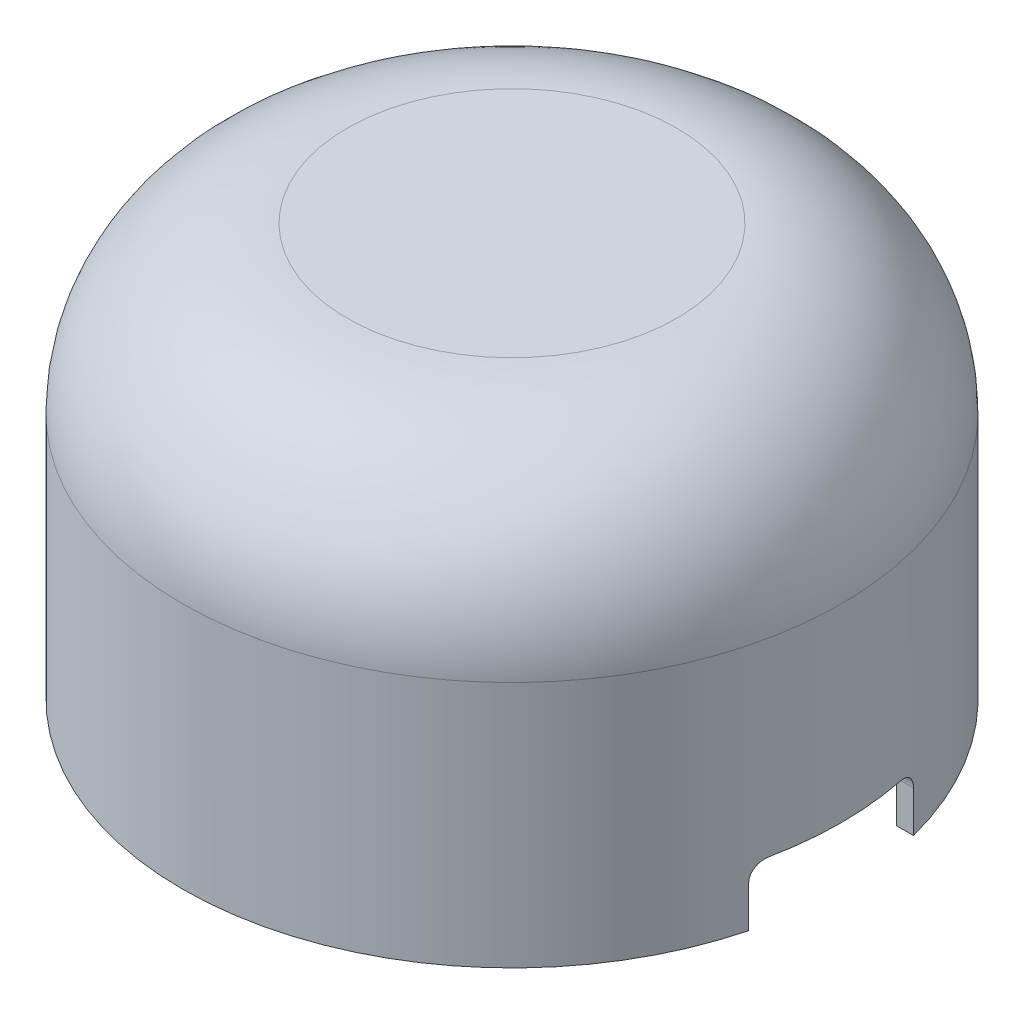
ISO-10303-21;
HEADER;
FILE_DESCRIPTION(('STEP AP214'),'2;1');
FILE_NAME('part.step','',(''),(''),'','','');
FILE_SCHEMA(('AUTOMOTIVE_DESIGN { 1 0 10303 214 1 1 1 1 }'));
ENDSEC;
DATA;
#1=APPLICATION_CONTEXT('core data for automotive mechanical design processes');
#2=APPLICATION_PROTOCOL_DEFINITION('international standard','automotive_design',2000,#1);
#3=PRODUCT_CONTEXT('',#1,'mechanical');
#4=PRODUCT('Part','Part','',(#3));
#5=PRODUCT_RELATED_PRODUCT_CATEGORY('part','',(#4));
#6=PRODUCT_DEFINITION_FORMATION('','',#4);
#7=PRODUCT_DEFINITION_CONTEXT('part definition',#1,'design');
#8=PRODUCT_DEFINITION('design','',#6,#7);
#9=PRODUCT_DEFINITION_SHAPE('','',#8);
#10=(LENGTH_UNIT() NAMED_UNIT(*) SI_UNIT(.MILLI.,.METRE.));
#11=(NAMED_UNIT(*) PLANE_ANGLE_UNIT() SI_UNIT($,.RADIAN.));
#12=(NAMED_UNIT(*) SI_UNIT($,.STERADIAN.) SOLID_ANGLE_UNIT());
#13=UNCERTAINTY_MEASURE_WITH_UNIT(LENGTH_MEASURE(1.E-05),#10,'distance_accuracy_value','');
#14=(GEOMETRIC_REPRESENTATION_CONTEXT(3) GLOBAL_UNCERTAINTY_ASSIGNED_CONTEXT((#13)) GLOBAL_UNIT_ASSIGNED_CONTEXT((#10,
#11,#12)) REPRESENTATION_CONTEXT('',''));
#15=CARTESIAN_POINT('',(0.,0.,0.));
#16=DIRECTION('',(0.,0.,1.));
#17=DIRECTION('',(1.,0.,0.));
#18=AXIS2_PLACEMENT_3D('',#15,#16,#17);
#19=CARTESIAN_POINT('',(0.,0.,0.));
#20=DIRECTION('',(0.,-1.,0.));
#21=DIRECTION('',(0.,0.,-1.));
#22=AXIS2_PLACEMENT_3D('',#19,#20,#21);
#23=PLANE('',#22);
#24=CARTESIAN_POINT('',(0.,0.,0.));
#25=DIRECTION('',(0.,-1.,0.));
#26=DIRECTION('',(0.,0.,-1.));
#27=AXIS2_PLACEMENT_3D('',#24,#25,#26);
#28=CIRCLE('',#27,38.);
#29=CARTESIAN_POINT('',(36.6606055596467,1.45716771982052E-13,10.));
#30=VERTEX_POINT('',#29);
#31=CARTESIAN_POINT('',(36.6606055596467,1.49390712379494E-13,-10.));
#32=VERTEX_POINT('',#31);
#33=EDGE_CURVE('E119',#30,#32,#28,.T.);
#34=ORIENTED_EDGE('',*,*,#33,.F.);
#35=DIRECTION('',(-1.,0.,0.));
#36=VECTOR('',#35,1.);
#37=CARTESIAN_POINT('',(56.,1.45716771982052E-13,10.));
#38=LINE('',#37,#36);
#39=CARTESIAN_POINT('',(38.7298334620742,1.45716771982052E-13,10.));
#40=VERTEX_POINT('',#39);
#41=EDGE_CURVE('E58',#40,#30,#38,.T.);
#42=ORIENTED_EDGE('',*,*,#41,.F.);
#43=CARTESIAN_POINT('',(0.,1.45716771982052E-13,0.));
#44=DIRECTION('',(0.,-1.,0.));
#45=DIRECTION('',(0.,0.,-1.));
#46=AXIS2_PLACEMENT_3D('',#43,#44,#45);
#47=CIRCLE('',#46,40.);
#48=CARTESIAN_POINT('',(38.7298334620742,1.49390712379494E-13,-10.));
#49=VERTEX_POINT('',#48);
#50=EDGE_CURVE('E105',#40,#49,#47,.T.);
#51=ORIENTED_EDGE('',*,*,#50,.T.);
#52=DIRECTION('',(-1.,0.,0.));
#53=VECTOR('',#52,1.);
#54=CARTESIAN_POINT('',(56.,1.49390712379494E-13,-10.));
#55=LINE('',#54,#53);
#56=EDGE_CURVE('E190',#49,#32,#55,.T.);
#57=ORIENTED_EDGE('',*,*,#56,.T.);
#58=EDGE_LOOP('',(#34,#42,#51,#57));
#59=FACE_BOUND('',#58,.T.);
#60=ADVANCED_FACE('F38',(#59),#23,.T.);
#61=CARTESIAN_POINT('',(0.,0.,0.));
#62=DIRECTION('',(0.,-1.,0.));
#63=DIRECTION('',(0.,0.,-1.));
#64=AXIS2_PLACEMENT_3D('',#61,#62,#63);
#65=CYLINDRICAL_SURFACE('',#64,40.);
#66=CARTESIAN_POINT('',(0.,30.,0.));
#67=DIRECTION('',(0.,-1.,0.));
#68=DIRECTION('',(0.,0.,-1.));
#69=AXIS2_PLACEMENT_3D('',#66,#67,#68);
#70=CIRCLE('',#69,40.);
#71=CARTESIAN_POINT('',(0.,30.,-40.));
#72=VERTEX_POINT('',#71);
#73=EDGE_CURVE('E127',#72,#72,#70,.T.);
#74=ORIENTED_EDGE('',*,*,#73,.T.);
#75=EDGE_LOOP('',(#74));
#76=FACE_BOUND('',#75,.T.);
#77=ORIENTED_EDGE('',*,*,#50,.F.);
#78=DIRECTION('',(0.,-1.,0.));
#79=VECTOR('',#78,1.);
#80=CARTESIAN_POINT('',(38.7298334620742,0.,10.));
#81=LINE('',#80,#79);
#82=CARTESIAN_POINT('',(38.7298334620742,5.00000000000013,10.));
#83=VERTEX_POINT('',#82);
#84=EDGE_CURVE('E98',#40,#83,#81,.F.);
#85=ORIENTED_EDGE('',*,*,#84,.T.);
#86=CARTESIAN_POINT('',(38.7298334620742,5.00000000000013,10.));
#87=CARTESIAN_POINT('',(38.7298326194399,5.05505160137666,10.0000005771362));
#88=CARTESIAN_POINT('',(38.7304208108248,5.11007627264321,9.99772549905803));
#89=CARTESIAN_POINT('',(38.7327612192509,5.21972012451846,9.98865560864686));
#90=CARTESIAN_POINT('',(38.7345132925186,5.27433935436848,9.98186135456433));
#91=CARTESIAN_POINT('',(38.741482310767,5.43679792983441,9.95479366464594));
#92=CARTESIAN_POINT('',(38.748412211819,5.54353002242645,9.92783491494343));
#93=CARTESIAN_POINT('',(38.7664981412727,5.75077277523149,9.85697423116709));
#94=CARTESIAN_POINT('',(38.7776546537335,5.85128272130917,9.81307035641617));
#95=CARTESIAN_POINT('',(38.8036640630983,6.0434501089711,9.70971086036322));
#96=CARTESIAN_POINT('',(38.8185173935021,6.13510651061183,9.65025341516215));
#97=CARTESIAN_POINT('',(38.8515119609192,6.30852357271044,9.51655489343727));
#98=CARTESIAN_POINT('',(38.8696999376451,6.3901117678665,9.44210194949403));
#99=CARTESIAN_POINT('',(38.908447298594,6.53972609163972,9.28114062482061));
#100=CARTESIAN_POINT('',(38.9290073202375,6.60774856138726,9.19462900235315));
#101=CARTESIAN_POINT('',(38.9723255318063,6.73033321970062,9.00928119652171));
#102=CARTESIAN_POINT('',(38.9951300936365,6.78444930401798,8.91016096701512));
#103=CARTESIAN_POINT('',(39.0415696534439,6.87521264192984,8.7044208509998));
#104=CARTESIAN_POINT('',(39.0652043721719,6.91186571046095,8.59780347452467));
#105=CARTESIAN_POINT('',(39.1061917820344,6.95945180480397,8.40906887903328));
#106=CARTESIAN_POINT('',(39.1235399315422,6.9746361473541,8.32799514260831));
#107=CARTESIAN_POINT('',(39.1579577626541,6.99491136718172,8.16464317071732));
#108=CARTESIAN_POINT('',(39.1750277591468,7.00001457757774,8.08236653122535));
#109=CARTESIAN_POINT('',(39.1918358845309,7.00000000000015,7.99999999999999));
#110=B_SPLINE_CURVE_WITH_KNOTS('',3,(#86,#87,#88,#89,#90,#91,#92,#93,#94,#95,#96,#97,#98,#99,
#100,#101,#102,#103,#104,#105,#106,#107,#108,#109),.UNSPECIFIED.,.F.,.F.,(4,2,2,2,2,2,2,2,2,2,2,
4),(0.,0.165051489223085,0.330082593544818,0.659280561114503,0.988516241986097,1.31779054820353,
1.65209249814677,1.98648449251229,2.33054597314569,2.67449280597505,2.92677175863386,
3.17874188508126),.UNSPECIFIED.);
#111=CARTESIAN_POINT('',(39.1918358845308,7.00000000000015,7.99999999999999));
#112=VERTEX_POINT('',#111);
#113=EDGE_CURVE('E88',#83,#112,#110,.T.);
#114=ORIENTED_EDGE('',*,*,#113,.T.);
#115=CARTESIAN_POINT('',(0.,7.00000000000015,0.));
#116=DIRECTION('',(0.,-1.,0.));
#117=DIRECTION('',(0.,0.,-1.));
#118=AXIS2_PLACEMENT_3D('',#115,#116,#117);
#119=CIRCLE('',#118,40.);
#120=CARTESIAN_POINT('',(39.1918358845308,7.00000000000015,-7.99999999999998));
#121=VERTEX_POINT('',#120);
#122=EDGE_CURVE('E95',#112,#121,#119,.F.);
#123=ORIENTED_EDGE('',*,*,#122,.T.);
#124=CARTESIAN_POINT('',(39.1918358845308,7.00000000000015,-7.99999999999998));
#125=CARTESIAN_POINT('',(39.1801057078813,6.99999901500845,-8.05746948791519));
#126=CARTESIAN_POINT('',(39.1682533332822,6.99752152938724,-8.11488455451955));
#127=CARTESIAN_POINT('',(39.1443841446907,6.98764719836224,-8.22925235277903));
#128=CARTESIAN_POINT('',(39.1323673398534,6.98025062575647,-8.2862051098952));
#129=CARTESIAN_POINT('',(39.0962185712984,6.95075707998548,-8.45570701496808));
#130=CARTESIAN_POINT('',(39.0719583370319,6.92135609231627,-8.56704617002827));
#131=CARTESIAN_POINT('',(39.023951163637,6.84387969088688,-8.78313882317792));
#132=CARTESIAN_POINT('',(39.0002044603987,6.79579587977729,-8.88788933524318));
#133=CARTESIAN_POINT('',(38.9541020246381,6.6822172660947,-9.08781928750434));
#134=CARTESIAN_POINT('',(38.9317459839982,6.61672633734874,-9.18300085071256));
#135=CARTESIAN_POINT('',(38.8894386886249,6.47040143090749,-9.36054832853201));
#136=CARTESIAN_POINT('',(38.8694762471487,6.3896437683989,-9.44297442866076));
#137=CARTESIAN_POINT('',(38.8327157250863,6.21471668249304,-9.59302732370191));
#138=CARTESIAN_POINT('',(38.8159179857379,6.12054581472178,-9.66065252281723));
#139=CARTESIAN_POINT('',(38.7866522378173,5.92377161247141,-9.77748257215076));
#140=CARTESIAN_POINT('',(38.7740937298787,5.82141132950929,-9.82707446259781));
#141=CARTESIAN_POINT('',(38.7534271823976,5.60941442866302,-9.90826189527754));
#142=CARTESIAN_POINT('',(38.7453145663691,5.49978542385804,-9.93987594470187));
#143=CARTESIAN_POINT('',(38.7363844819205,5.32435228397763,-9.97460170824541));
#144=CARTESIAN_POINT('',(38.7339310923897,5.25983141157121,-9.98412000028461));
#145=CARTESIAN_POINT('',(38.7306553087111,5.13021792680457,-9.99681726592573));
#146=CARTESIAN_POINT('',(38.7298306748911,5.06512622335207,-10.0000049446716));
#147=CARTESIAN_POINT('',(38.7298334620742,5.00000000000014,-10.));
#148=B_SPLINE_CURVE_WITH_KNOTS('',3,(#124,#125,#126,#127,#128,#129,#130,#131,#132,#133,#134,
#135,#136,#137,#138,#139,#140,#141,#142,#143,#144,#145,#146,#147),.UNSPECIFIED.,.F.,.F.,(4,2,2,
2,2,2,2,2,2,2,2,4),(0.,0.175853868904391,0.351697986286411,0.70294371193858,1.05434749461421,
1.4056731403232,1.75528692228245,2.10493838019947,2.4465673555439,2.7878440031478,
2.98334115976407,3.17856930413358),.UNSPECIFIED.);
#149=CARTESIAN_POINT('',(38.7298334620742,5.00000000000014,-10.));
#150=VERTEX_POINT('',#149);
#151=EDGE_CURVE('E112',#121,#150,#148,.T.);
#152=ORIENTED_EDGE('',*,*,#151,.T.);
#153=DIRECTION('',(0.,-1.,0.));
#154=VECTOR('',#153,1.);
#155=CARTESIAN_POINT('',(38.7298334620742,0.,-10.));
#156=LINE('',#155,#154);
#157=EDGE_CURVE('E107',#150,#49,#156,.T.);
#158=ORIENTED_EDGE('',*,*,#157,.T.);
#159=EDGE_LOOP('',(#77,#85,#114,#123,#152,#158));
#160=FACE_BOUND('',#159,.T.);
#161=ADVANCED_FACE('F102',(#76,#160),#65,.T.);
#162=CARTESIAN_POINT('',(0.,0.,0.));
#163=DIRECTION('',(0.,-1.,0.));
#164=DIRECTION('',(0.,0.,-1.));
#165=AXIS2_PLACEMENT_3D('',#162,#163,#164);
#166=CYLINDRICAL_SURFACE('',#165,38.);
#167=CARTESIAN_POINT('',(0.,30.,0.));
#168=DIRECTION('',(0.,-1.,0.));
#169=DIRECTION('',(0.,0.,-1.));
#170=AXIS2_PLACEMENT_3D('',#167,#168,#169);
#171=CIRCLE('',#170,38.);
#172=CARTESIAN_POINT('',(0.,30.,-38.));
#173=VERTEX_POINT('',#172);
#174=EDGE_CURVE('E116',#173,#173,#171,.T.);
#175=ORIENTED_EDGE('',*,*,#174,.F.);
#176=EDGE_LOOP('',(#175));
#177=FACE_BOUND('',#176,.T.);
#178=DIRECTION('',(0.,-1.,0.));
#179=VECTOR('',#178,1.);
#180=CARTESIAN_POINT('',(36.6606055596467,0.,10.));
#181=LINE('',#180,#179);
#182=CARTESIAN_POINT('',(36.6606055596467,5.00000000000013,10.));
#183=VERTEX_POINT('',#182);
#184=EDGE_CURVE('E11',#30,#183,#181,.F.);
#185=ORIENTED_EDGE('',*,*,#184,.F.);
#186=ORIENTED_EDGE('',*,*,#33,.T.);
#187=DIRECTION('',(0.,-1.,0.));
#188=VECTOR('',#187,1.);
#189=CARTESIAN_POINT('',(36.6606055596467,0.,-10.));
#190=LINE('',#189,#188);
#191=CARTESIAN_POINT('',(36.6606055596467,5.00000000000014,-10.));
#192=VERTEX_POINT('',#191);
#193=EDGE_CURVE('E45',#192,#32,#190,.T.);
#194=ORIENTED_EDGE('',*,*,#193,.F.);
#195=CARTESIAN_POINT('',(37.1483512420134,7.00000000000015,-7.99999999999998));
#196=CARTESIAN_POINT('',(37.1359464187979,6.99999894302811,-8.05760596565562));
#197=CARTESIAN_POINT('',(37.1234120687922,6.99750975976636,-8.11515426090105));
#198=CARTESIAN_POINT('',(37.0981688710217,6.9875899086923,-8.22978143171024));
#199=CARTESIAN_POINT('',(37.0854600331479,6.98015951985332,-8.2868603335911));
#200=CARTESIAN_POINT('',(37.0472274688415,6.95053228266421,-8.45673396601103));
#201=CARTESIAN_POINT('',(37.0215671439249,6.9209991783334,-8.56830729133277));
#202=CARTESIAN_POINT('',(36.9707870479754,6.84317510055917,-8.78483424486615));
#203=CARTESIAN_POINT('',(36.9456675229772,6.79487577218744,-8.88978490036685));
#204=CARTESIAN_POINT('',(36.896899159019,6.6807761897725,-9.09007455029695));
#205=CARTESIAN_POINT('',(36.8732499883708,6.6149799005632,-9.18541571550812));
#206=CARTESIAN_POINT('',(36.8285127388379,6.46798817032521,-9.36317374418333));
#207=CARTESIAN_POINT('',(36.8074114461195,6.38687831744895,-9.44565799817652));
#208=CARTESIAN_POINT('',(36.7685667084205,6.21115983442327,-9.59575577833714));
#209=CARTESIAN_POINT('',(36.7508235855586,6.11654991085956,-9.66336787805445));
#210=CARTESIAN_POINT('',(36.7199802677687,5.91909705151461,-9.77990815292064));
#211=CARTESIAN_POINT('',(36.706772930342,5.81652657521087,-9.82926996625864));
#212=CARTESIAN_POINT('',(36.6850724901174,5.604104365095,-9.90995559448285));
#213=CARTESIAN_POINT('',(36.6765742961966,5.49426063894615,-9.94129889082567));
#214=CARTESIAN_POINT('',(36.6673218022046,5.31954882597425,-9.97535284630271));
#215=CARTESIAN_POINT('',(36.6648064907828,5.2559747811444,-9.98458967127195));
#216=CARTESIAN_POINT('',(36.6614481547515,5.12827804909862,-9.9969112727901));
#217=CARTESIAN_POINT('',(36.6606028384306,5.06415623518913,-10.0000044801728));
#218=CARTESIAN_POINT('',(36.6606055596467,5.00000000000014,-10.));
#219=B_SPLINE_CURVE_WITH_KNOTS('',3,(#195,#196,#197,#198,#199,#200,#201,#202,#203,#204,#205,
#206,#207,#208,#209,#210,#211,#212,#213,#214,#215,#216,#217,#218),.UNSPECIFIED.,.F.,.F.,(4,2,2,
2,2,2,2,2,2,2,2,4),(0.,0.17666935637176,0.353328739093099,0.706218249415838,1.05926505036908,
1.41223191853097,1.76328150279019,2.1143647430058,2.45646855473725,2.79820178790564,
2.99078768693056,3.1831091188704),.UNSPECIFIED.);
#220=CARTESIAN_POINT('',(37.1483512420134,7.00000000000015,-7.99999999999998));
#221=VERTEX_POINT('',#220);
#222=EDGE_CURVE('E181',#221,#192,#219,.T.);
#223=ORIENTED_EDGE('',*,*,#222,.F.);
#224=CARTESIAN_POINT('',(0.,7.00000000000015,0.));
#225=DIRECTION('',(0.,-1.,0.));
#226=DIRECTION('',(0.,0.,-1.));
#227=AXIS2_PLACEMENT_3D('',#224,#225,#226);
#228=CIRCLE('',#227,38.);
#229=CARTESIAN_POINT('',(37.1483512420134,7.00000000000015,7.99999999999999));
#230=VERTEX_POINT('',#229);
#231=EDGE_CURVE('E142',#230,#221,#228,.F.);
#232=ORIENTED_EDGE('',*,*,#231,.F.);
#233=CARTESIAN_POINT('',(36.6606055596467,5.00000000000013,10.));
#234=CARTESIAN_POINT('',(36.6606046434647,5.05491829537543,10.0000006776951));
#235=CARTESIAN_POINT('',(36.6612230604251,5.10980966034131,9.99773649397903));
#236=CARTESIAN_POINT('',(36.6636835349423,5.21918653987524,9.98871073377679));
#237=CARTESIAN_POINT('',(36.6655254310244,5.27367210704097,9.98194975077749));
#238=CARTESIAN_POINT('',(36.6728507349377,5.4357194433386,9.955018147065));
#239=CARTESIAN_POINT('',(36.6801339340306,5.54217454659948,9.9281984604827));
#240=CARTESIAN_POINT('',(36.6991363831679,5.74887106089773,9.85772299172213));
#241=CARTESIAN_POINT('',(36.7108559619464,5.8491120108281,9.81406596189901));
#242=CARTESIAN_POINT('',(36.7381707039434,6.04078021093682,9.7113144983516));
#243=CARTESIAN_POINT('',(36.7537664431917,6.13220614832579,9.652217770093));
#244=CARTESIAN_POINT('',(36.7884303652054,6.30536989064264,9.51925294667016));
#245=CARTESIAN_POINT('',(36.807552790613,6.38691779910324,9.44515203917684));
#246=CARTESIAN_POINT('',(36.8482877163027,6.53651839590566,9.28496166093408));
#247=CARTESIAN_POINT('',(36.8699009021578,6.60456735461614,9.19886888809892));
#248=CARTESIAN_POINT('',(36.9155098759612,6.7274993077524,9.01412549875827));
#249=CARTESIAN_POINT('',(36.9395598868405,6.78188934756866,8.91516040260958));
#250=CARTESIAN_POINT('',(36.9885418477311,6.8732197132662,8.70970197868858));
#251=CARTESIAN_POINT('',(37.013473526025,6.91016536574487,8.60321096036995));
#252=CARTESIAN_POINT('',(37.0569311238925,6.95851445110472,8.41372141279392));
#253=CARTESIAN_POINT('',(37.0754503476042,6.97404835505587,8.33174945851925));
#254=CARTESIAN_POINT('',(37.1121909419698,6.99479250699741,8.16654983750247));
#255=CARTESIAN_POINT('',(37.1304126439031,7.0000151422575,8.08332379865601));
#256=CARTESIAN_POINT('',(37.1483512420134,7.00000000000015,7.99999999999999));
#257=B_SPLINE_CURVE_WITH_KNOTS('',3,(#233,#234,#235,#236,#237,#238,#239,#240,#241,#242,#243,
#244,#245,#246,#247,#248,#249,#250,#251,#252,#253,#254,#255,#256),.UNSPECIFIED.,.F.,.F.,(4,2,2,
2,2,2,2,2,2,2,2,4),(0.,0.16465160182963,0.329281477277663,0.657644917302884,0.986032693690755,
1.31446930043991,1.64845789601875,1.98253864133571,2.32734735710587,2.67205071825195,
2.92782971891788,3.18330125634885),.UNSPECIFIED.);
#258=EDGE_CURVE('E134',#183,#230,#257,.T.);
#259=ORIENTED_EDGE('',*,*,#258,.F.);
#260=EDGE_LOOP('',(#185,#186,#194,#223,#232,#259));
#261=FACE_BOUND('',#260,.T.);
#262=ADVANCED_FACE('F144',(#177,#261),#166,.F.);
#263=CARTESIAN_POINT('',(0.,30.,0.));
#264=DIRECTION('',(0.,-1.,0.));
#265=DIRECTION('',(0.,0.,-1.));
#266=AXIS2_PLACEMENT_3D('',#263,#264,#265);
#267=TOROIDAL_SURFACE('',#266,20.,20.);
#268=CARTESIAN_POINT('',(0.,50.,0.));
#269=DIRECTION('',(0.,-1.,0.));
#270=DIRECTION('',(0.,0.,-1.));
#271=AXIS2_PLACEMENT_3D('',#268,#269,#270);
#272=CIRCLE('',#271,20.);
#273=CARTESIAN_POINT('',(0.,50.,-20.));
#274=VERTEX_POINT('',#273);
#275=EDGE_CURVE('E124',#274,#274,#272,.T.);
#276=ORIENTED_EDGE('',*,*,#275,.T.);
#277=EDGE_LOOP('',(#276));
#278=FACE_BOUND('',#277,.T.);
#279=ORIENTED_EDGE('',*,*,#73,.F.);
#280=EDGE_LOOP('',(#279));
#281=FACE_BOUND('',#280,.T.);
#282=ADVANCED_FACE('F165',(#278,#281),#267,.T.);
#283=CARTESIAN_POINT('',(0.,50.,0.));
#284=DIRECTION('',(0.,1.,0.));
#285=DIRECTION('',(0.,0.,1.));
#286=AXIS2_PLACEMENT_3D('',#283,#284,#285);
#287=PLANE('',#286);
#288=ORIENTED_EDGE('',*,*,#275,.F.);
#289=EDGE_LOOP('',(#288));
#290=FACE_BOUND('',#289,.T.);
#291=ADVANCED_FACE('F229',(#290),#287,.T.);
#292=CARTESIAN_POINT('',(0.,30.,0.));
#293=DIRECTION('',(0.,-1.,0.));
#294=DIRECTION('',(0.,0.,-1.));
#295=AXIS2_PLACEMENT_3D('',#292,#293,#294);
#296=TOROIDAL_SURFACE('',#295,20.,18.);
#297=CARTESIAN_POINT('',(0.,48.,0.));
#298=DIRECTION('',(0.,-1.,0.));
#299=DIRECTION('',(0.,0.,-1.));
#300=AXIS2_PLACEMENT_3D('',#297,#298,#299);
#301=CIRCLE('',#300,20.);
#302=CARTESIAN_POINT('',(0.,48.,-20.));
#303=VERTEX_POINT('',#302);
#304=EDGE_CURVE('E110',#303,#303,#301,.T.);
#305=ORIENTED_EDGE('',*,*,#304,.F.);
#306=EDGE_LOOP('',(#305));
#307=FACE_BOUND('',#306,.T.);
#308=ORIENTED_EDGE('',*,*,#174,.T.);
#309=EDGE_LOOP('',(#308));
#310=FACE_BOUND('',#309,.T.);
#311=ADVANCED_FACE('F236',(#307,#310),#296,.F.);
#312=CARTESIAN_POINT('',(0.,48.,0.));
#313=DIRECTION('',(0.,1.,0.));
#314=DIRECTION('',(0.,0.,1.));
#315=AXIS2_PLACEMENT_3D('',#312,#313,#314);
#316=PLANE('',#315);
#317=CARTESIAN_POINT('',(0.,48.,0.));
#318=DIRECTION('',(0.,1.,0.));
#319=DIRECTION('',(0.,0.,1.));
#320=AXIS2_PLACEMENT_3D('',#317,#318,#319);
#321=CIRCLE('',#320,2.5);
#322=CARTESIAN_POINT('',(0.,48.,2.5));
#323=VERTEX_POINT('',#322);
#324=EDGE_CURVE('E131',#323,#323,#321,.F.);
#325=ORIENTED_EDGE('',*,*,#324,.F.);
#326=EDGE_LOOP('',(#325));
#327=FACE_BOUND('',#326,.T.);
#328=ORIENTED_EDGE('',*,*,#304,.T.);
#329=EDGE_LOOP('',(#328));
#330=FACE_BOUND('',#329,.T.);
#331=ADVANCED_FACE('F243',(#327,#330),#316,.F.);
#332=CARTESIAN_POINT('',(0.,-7.,0.));
#333=DIRECTION('',(0.,1.,0.));
#334=DIRECTION('',(0.,0.,1.));
#335=AXIS2_PLACEMENT_3D('',#332,#333,#334);
#336=CYLINDRICAL_SURFACE('',#335,2.5);
#337=CARTESIAN_POINT('',(0.,-7.,0.));
#338=DIRECTION('',(0.,-1.,0.));
#339=DIRECTION('',(0.,0.,-1.));
#340=AXIS2_PLACEMENT_3D('',#337,#338,#339);
#341=CIRCLE('',#340,2.5);
#342=CARTESIAN_POINT('',(0.,-7.,-2.5));
#343=VERTEX_POINT('',#342);
#344=EDGE_CURVE('E106',#343,#343,#341,.T.);
#345=ORIENTED_EDGE('',*,*,#344,.F.);
#346=EDGE_LOOP('',(#345));
#347=FACE_BOUND('',#346,.T.);
#348=ORIENTED_EDGE('',*,*,#324,.T.);
#349=EDGE_LOOP('',(#348));
#350=FACE_BOUND('',#349,.T.);
#351=ADVANCED_FACE('F250',(#347,#350),#336,.T.);
#352=CARTESIAN_POINT('',(0.,-7.,0.));
#353=DIRECTION('',(0.,-1.,0.));
#354=DIRECTION('',(0.,0.,-1.));
#355=AXIS2_PLACEMENT_3D('',#352,#353,#354);
#356=PLANE('',#355);
#357=ORIENTED_EDGE('',*,*,#344,.T.);
#358=EDGE_LOOP('',(#357));
#359=FACE_BOUND('',#358,.T.);
#360=ADVANCED_FACE('F258',(#359),#356,.T.);
#361=CARTESIAN_POINT('',(56.,1.45716771982052E-13,10.));
#362=DIRECTION('',(0.,0.,-1.));
#363=DIRECTION('',(-1.,0.,0.));
#364=AXIS2_PLACEMENT_3D('',#361,#362,#363);
#365=PLANE('',#364);
#366=ORIENTED_EDGE('',*,*,#41,.T.);
#367=ORIENTED_EDGE('',*,*,#184,.T.);
#368=DIRECTION('',(-1.,0.,0.));
#369=VECTOR('',#368,1.);
#370=CARTESIAN_POINT('',(56.,5.00000000000013,10.));
#371=LINE('',#370,#369);
#372=EDGE_CURVE('E52',#83,#183,#371,.T.);
#373=ORIENTED_EDGE('',*,*,#372,.F.);
#374=ORIENTED_EDGE('',*,*,#84,.F.);
#375=EDGE_LOOP('',(#366,#367,#373,#374));
#376=FACE_BOUND('',#375,.T.);
#377=ADVANCED_FACE('F97',(#376),#365,.T.);
#378=CARTESIAN_POINT('',(56.,5.00000000000014,-10.));
#379=DIRECTION('',(0.,0.,1.));
#380=DIRECTION('',(0.,-1.,0.));
#381=AXIS2_PLACEMENT_3D('',#378,#379,#380);
#382=PLANE('',#381);
#383=DIRECTION('',(-1.,0.,0.));
#384=VECTOR('',#383,1.);
#385=CARTESIAN_POINT('',(56.,5.00000000000014,-10.));
#386=LINE('',#385,#384);
#387=EDGE_CURVE('E192',#150,#192,#386,.T.);
#388=ORIENTED_EDGE('',*,*,#387,.T.);
#389=ORIENTED_EDGE('',*,*,#193,.T.);
#390=ORIENTED_EDGE('',*,*,#56,.F.);
#391=ORIENTED_EDGE('',*,*,#157,.F.);
#392=EDGE_LOOP('',(#388,#389,#390,#391));
#393=FACE_BOUND('',#392,.T.);
#394=ADVANCED_FACE('F177',(#393),#382,.T.);
#395=CARTESIAN_POINT('',(56.,5.00000000000015,-8.));
#396=DIRECTION('',(-1.,0.,0.));
#397=DIRECTION('',(0.,0.,1.));
#398=AXIS2_PLACEMENT_3D('',#395,#396,#397);
#399=CYLINDRICAL_SURFACE('',#398,2.);
#400=DIRECTION('',(-1.,0.,0.));
#401=VECTOR('',#400,1.);
#402=CARTESIAN_POINT('',(56.,7.00000000000015,-7.99999999999998));
#403=LINE('',#402,#401);
#404=EDGE_CURVE('E201',#121,#221,#403,.T.);
#405=ORIENTED_EDGE('',*,*,#404,.T.);
#406=ORIENTED_EDGE('',*,*,#222,.T.);
#407=ORIENTED_EDGE('',*,*,#387,.F.);
#408=ORIENTED_EDGE('',*,*,#151,.F.);
#409=EDGE_LOOP('',(#405,#406,#407,#408));
#410=FACE_BOUND('',#409,.T.);
#411=ADVANCED_FACE('F173',(#410),#399,.F.);
#412=CARTESIAN_POINT('',(56.,7.00000000000015,7.99999999999999));
#413=DIRECTION('',(0.,-1.,0.));
#414=DIRECTION('',(0.,0.,-1.));
#415=AXIS2_PLACEMENT_3D('',#412,#413,#414);
#416=PLANE('',#415);
#417=DIRECTION('',(-1.,0.,0.));
#418=VECTOR('',#417,1.);
#419=CARTESIAN_POINT('',(56.,7.00000000000015,7.99999999999999));
#420=LINE('',#419,#418);
#421=EDGE_CURVE('E91',#112,#230,#420,.T.);
#422=ORIENTED_EDGE('',*,*,#421,.T.);
#423=ORIENTED_EDGE('',*,*,#231,.T.);
#424=ORIENTED_EDGE('',*,*,#404,.F.);
#425=ORIENTED_EDGE('',*,*,#122,.F.);
#426=EDGE_LOOP('',(#422,#423,#424,#425));
#427=FACE_BOUND('',#426,.T.);
#428=ADVANCED_FACE('F151',(#427),#416,.T.);
#429=CARTESIAN_POINT('',(56.,5.00000000000015,8.));
#430=DIRECTION('',(-1.,0.,0.));
#431=DIRECTION('',(0.,0.,1.));
#432=AXIS2_PLACEMENT_3D('',#429,#430,#431);
#433=CYLINDRICAL_SURFACE('',#432,2.);
#434=ORIENTED_EDGE('',*,*,#372,.T.);
#435=ORIENTED_EDGE('',*,*,#258,.T.);
#436=ORIENTED_EDGE('',*,*,#421,.F.);
#437=ORIENTED_EDGE('',*,*,#113,.F.);
#438=EDGE_LOOP('',(#434,#435,#436,#437));
#439=FACE_BOUND('',#438,.T.);
#440=ADVANCED_FACE('F89',(#439),#433,.F.);
#441=CLOSED_SHELL('',(#60,#161,#262,#282,#291,#311,#331,#351,#360,#377,#394,#411,#428,#440));
#442=MANIFOLD_SOLID_BREP('B2',#441);
#443=ADVANCED_BREP_SHAPE_REPRESENTATION('',(#18,#442),#14);
#444=SHAPE_DEFINITION_REPRESENTATION(#9,#443);
ENDSEC;
END-ISO-10303-21;
